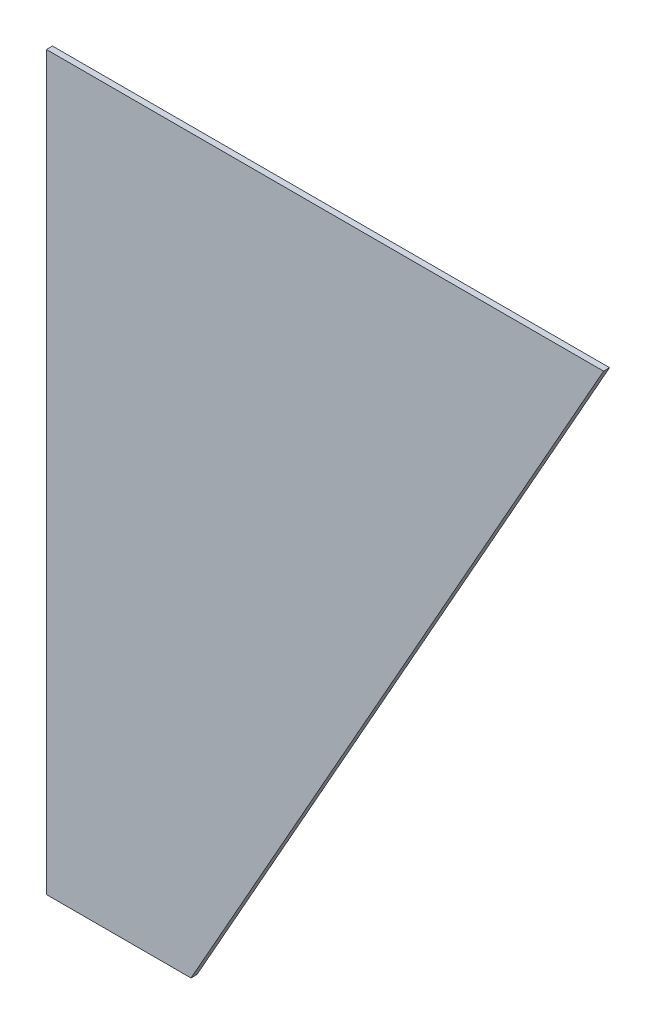
ISO-10303-21;
HEADER;
FILE_DESCRIPTION(('STEP AP214'),'2;1');
FILE_NAME('part.step','',(''),(''),'','','');
FILE_SCHEMA(('AUTOMOTIVE_DESIGN { 1 0 10303 214 1 1 1 1 }'));
ENDSEC;
DATA;
#1=APPLICATION_CONTEXT('core data for automotive mechanical design processes');
#2=APPLICATION_PROTOCOL_DEFINITION('international standard','automotive_design',2000,#1);
#3=PRODUCT_CONTEXT('',#1,'mechanical');
#4=PRODUCT('Part','Part','',(#3));
#5=PRODUCT_RELATED_PRODUCT_CATEGORY('part','',(#4));
#6=PRODUCT_DEFINITION_FORMATION('','',#4);
#7=PRODUCT_DEFINITION_CONTEXT('part definition',#1,'design');
#8=PRODUCT_DEFINITION('design','',#6,#7);
#9=PRODUCT_DEFINITION_SHAPE('','',#8);
#10=(LENGTH_UNIT() NAMED_UNIT(*) SI_UNIT(.MILLI.,.METRE.));
#11=(NAMED_UNIT(*) PLANE_ANGLE_UNIT() SI_UNIT($,.RADIAN.));
#12=(NAMED_UNIT(*) SI_UNIT($,.STERADIAN.) SOLID_ANGLE_UNIT());
#13=UNCERTAINTY_MEASURE_WITH_UNIT(LENGTH_MEASURE(1.E-05),#10,'distance_accuracy_value','');
#14=(GEOMETRIC_REPRESENTATION_CONTEXT(3) GLOBAL_UNCERTAINTY_ASSIGNED_CONTEXT((#13)) GLOBAL_UNIT_ASSIGNED_CONTEXT((#10,
#11,#12)) REPRESENTATION_CONTEXT('',''));
#15=CARTESIAN_POINT('',(0.,0.,0.));
#16=DIRECTION('',(0.,0.,1.));
#17=DIRECTION('',(1.,0.,0.));
#18=AXIS2_PLACEMENT_3D('',#15,#16,#17);
#19=CARTESIAN_POINT('',(0.,0.,2.));
#20=DIRECTION('',(1.,0.,0.));
#21=DIRECTION('',(0.,1.,0.));
#22=AXIS2_PLACEMENT_3D('',#19,#20,#21);
#23=PLANE('',#22);
#24=DIRECTION('',(0.,-1.,0.));
#25=VECTOR('',#24,1.);
#26=CARTESIAN_POINT('',(0.,0.,0.));
#27=LINE('',#26,#25);
#28=CARTESIAN_POINT('',(0.,0.,0.));
#29=VERTEX_POINT('',#28);
#30=CARTESIAN_POINT('',(0.,-243.,0.));
#31=VERTEX_POINT('',#30);
#32=EDGE_CURVE('E100',#29,#31,#27,.T.);
#33=ORIENTED_EDGE('',*,*,#32,.T.);
#34=DIRECTION('',(0.,0.,-1.));
#35=VECTOR('',#34,1.);
#36=CARTESIAN_POINT('',(0.,-243.,2.));
#37=LINE('',#36,#35);
#38=CARTESIAN_POINT('',(0.,-243.,2.));
#39=VERTEX_POINT('',#38);
#40=EDGE_CURVE('E11',#39,#31,#37,.T.);
#41=ORIENTED_EDGE('',*,*,#40,.F.);
#42=DIRECTION('',(0.,-1.,0.));
#43=VECTOR('',#42,1.);
#44=CARTESIAN_POINT('',(0.,0.,2.));
#45=LINE('',#44,#43);
#46=CARTESIAN_POINT('',(0.,0.,2.));
#47=VERTEX_POINT('',#46);
#48=EDGE_CURVE('E88',#47,#39,#45,.T.);
#49=ORIENTED_EDGE('',*,*,#48,.F.);
#50=DIRECTION('',(0.,0.,-1.));
#51=VECTOR('',#50,1.);
#52=CARTESIAN_POINT('',(0.,0.,2.));
#53=LINE('',#52,#51);
#54=EDGE_CURVE('E96',#47,#29,#53,.T.);
#55=ORIENTED_EDGE('',*,*,#54,.T.);
#56=EDGE_LOOP('',(#33,#41,#49,#55));
#57=FACE_BOUND('',#56,.T.);
#58=ADVANCED_FACE('F37',(#57),#23,.F.);
#59=CARTESIAN_POINT('',(0.,-243.,2.));
#60=DIRECTION('',(0.,1.,0.));
#61=DIRECTION('',(0.,0.,1.));
#62=AXIS2_PLACEMENT_3D('',#59,#60,#61);
#63=PLANE('',#62);
#64=DIRECTION('',(1.,0.,0.));
#65=VECTOR('',#64,1.);
#66=CARTESIAN_POINT('',(0.,-243.,0.));
#67=LINE('',#66,#65);
#68=CARTESIAN_POINT('',(48.,-243.,0.));
#69=VERTEX_POINT('',#68);
#70=EDGE_CURVE('E92',#31,#69,#67,.T.);
#71=ORIENTED_EDGE('',*,*,#70,.T.);
#72=DIRECTION('',(0.,0.,-1.));
#73=VECTOR('',#72,1.);
#74=CARTESIAN_POINT('',(48.,-243.,2.));
#75=LINE('',#74,#73);
#76=CARTESIAN_POINT('',(48.,-243.,2.));
#77=VERTEX_POINT('',#76);
#78=EDGE_CURVE('E45',#77,#69,#75,.T.);
#79=ORIENTED_EDGE('',*,*,#78,.F.);
#80=DIRECTION('',(1.,0.,0.));
#81=VECTOR('',#80,1.);
#82=CARTESIAN_POINT('',(0.,-243.,2.));
#83=LINE('',#82,#81);
#84=EDGE_CURVE('E83',#39,#77,#83,.T.);
#85=ORIENTED_EDGE('',*,*,#84,.F.);
#86=ORIENTED_EDGE('',*,*,#40,.T.);
#87=EDGE_LOOP('',(#71,#79,#85,#86));
#88=FACE_BOUND('',#87,.T.);
#89=ADVANCED_FACE('F91',(#88),#63,.F.);
#90=CARTESIAN_POINT('',(48.,-243.,2.));
#91=DIRECTION('',(-0.871096444665524,0.491111987321715,0.));
#92=DIRECTION('',(-0.491111987321715,-0.871096444665524,0.));
#93=AXIS2_PLACEMENT_3D('',#90,#91,#92);
#94=PLANE('',#93);
#95=DIRECTION('',(0.491111987321715,0.871096444665524,0.));
#96=VECTOR('',#95,1.);
#97=CARTESIAN_POINT('',(48.,-243.,0.));
#98=LINE('',#97,#96);
#99=CARTESIAN_POINT('',(185.,0.,0.));
#100=VERTEX_POINT('',#99);
#101=EDGE_CURVE('E70',#69,#100,#98,.T.);
#102=ORIENTED_EDGE('',*,*,#101,.T.);
#103=DIRECTION('',(0.,0.,-1.));
#104=VECTOR('',#103,1.);
#105=CARTESIAN_POINT('',(185.,0.,2.));
#106=LINE('',#105,#104);
#107=CARTESIAN_POINT('',(185.,0.,2.));
#108=VERTEX_POINT('',#107);
#109=EDGE_CURVE('E93',#108,#100,#106,.T.);
#110=ORIENTED_EDGE('',*,*,#109,.F.);
#111=DIRECTION('',(0.491111987321715,0.871096444665524,0.));
#112=VECTOR('',#111,1.);
#113=CARTESIAN_POINT('',(48.,-243.,2.));
#114=LINE('',#113,#112);
#115=EDGE_CURVE('E86',#77,#108,#114,.T.);
#116=ORIENTED_EDGE('',*,*,#115,.F.);
#117=ORIENTED_EDGE('',*,*,#78,.T.);
#118=EDGE_LOOP('',(#102,#110,#116,#117));
#119=FACE_BOUND('',#118,.T.);
#120=ADVANCED_FACE('F94',(#119),#94,.F.);
#121=CARTESIAN_POINT('',(0.,0.,2.));
#122=DIRECTION('',(0.,-1.,0.));
#123=DIRECTION('',(0.,0.,-1.));
#124=AXIS2_PLACEMENT_3D('',#121,#122,#123);
#125=PLANE('',#124);
#126=DIRECTION('',(-1.,0.,0.));
#127=VECTOR('',#126,1.);
#128=CARTESIAN_POINT('',(0.,0.,0.));
#129=LINE('',#128,#127);
#130=EDGE_CURVE('E76',#100,#29,#129,.T.);
#131=ORIENTED_EDGE('',*,*,#130,.T.);
#132=ORIENTED_EDGE('',*,*,#54,.F.);
#133=DIRECTION('',(-1.,0.,0.));
#134=VECTOR('',#133,1.);
#135=CARTESIAN_POINT('',(0.,0.,2.));
#136=LINE('',#135,#134);
#137=EDGE_CURVE('E53',#108,#47,#136,.T.);
#138=ORIENTED_EDGE('',*,*,#137,.F.);
#139=ORIENTED_EDGE('',*,*,#109,.T.);
#140=EDGE_LOOP('',(#131,#132,#138,#139));
#141=FACE_BOUND('',#140,.T.);
#142=ADVANCED_FACE('F107',(#141),#125,.F.);
#143=CARTESIAN_POINT('',(0.,0.,2.));
#144=DIRECTION('',(0.,0.,1.));
#145=DIRECTION('',(1.,0.,0.));
#146=AXIS2_PLACEMENT_3D('',#143,#144,#145);
#147=PLANE('',#146);
#148=ORIENTED_EDGE('',*,*,#48,.T.);
#149=ORIENTED_EDGE('',*,*,#84,.T.);
#150=ORIENTED_EDGE('',*,*,#115,.T.);
#151=ORIENTED_EDGE('',*,*,#137,.T.);
#152=EDGE_LOOP('',(#148,#149,#150,#151));
#153=FACE_BOUND('',#152,.T.);
#154=ADVANCED_FACE('F84',(#153),#147,.T.);
#155=CARTESIAN_POINT('',(0.,0.,0.));
#156=DIRECTION('',(0.,0.,1.));
#157=DIRECTION('',(1.,0.,0.));
#158=AXIS2_PLACEMENT_3D('',#155,#156,#157);
#159=PLANE('',#158);
#160=ORIENTED_EDGE('',*,*,#32,.F.);
#161=ORIENTED_EDGE('',*,*,#130,.F.);
#162=ORIENTED_EDGE('',*,*,#101,.F.);
#163=ORIENTED_EDGE('',*,*,#70,.F.);
#164=EDGE_LOOP('',(#160,#161,#162,#163));
#165=FACE_BOUND('',#164,.T.);
#166=ADVANCED_FACE('F110',(#165),#159,.F.);
#167=CLOSED_SHELL('',(#58,#89,#120,#142,#154,#166));
#168=MANIFOLD_SOLID_BREP('B2',#167);
#169=ADVANCED_BREP_SHAPE_REPRESENTATION('',(#18,#168),#14);
#170=SHAPE_DEFINITION_REPRESENTATION(#9,#169);
ENDSEC;
END-ISO-10303-21;
